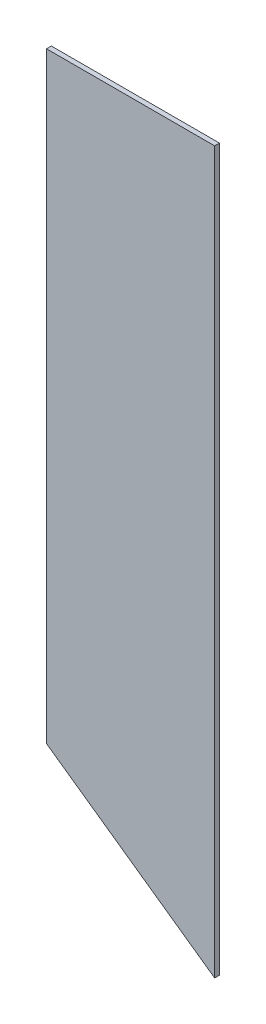
ISO-10303-21;
HEADER;
FILE_DESCRIPTION(('STEP AP214'),'2;1');
FILE_NAME('part.step','',(''),(''),'','','');
FILE_SCHEMA(('AUTOMOTIVE_DESIGN { 1 0 10303 214 1 1 1 1 }'));
ENDSEC;
DATA;
#1=APPLICATION_CONTEXT('core data for automotive mechanical design processes');
#2=APPLICATION_PROTOCOL_DEFINITION('international standard','automotive_design',2000,#1);
#3=PRODUCT_CONTEXT('',#1,'mechanical');
#4=PRODUCT('Part','Part','',(#3));
#5=PRODUCT_RELATED_PRODUCT_CATEGORY('part','',(#4));
#6=PRODUCT_DEFINITION_FORMATION('','',#4);
#7=PRODUCT_DEFINITION_CONTEXT('part definition',#1,'design');
#8=PRODUCT_DEFINITION('design','',#6,#7);
#9=PRODUCT_DEFINITION_SHAPE('','',#8);
#10=(LENGTH_UNIT() NAMED_UNIT(*) SI_UNIT(.MILLI.,.METRE.));
#11=(NAMED_UNIT(*) PLANE_ANGLE_UNIT() SI_UNIT($,.RADIAN.));
#12=(NAMED_UNIT(*) SI_UNIT($,.STERADIAN.) SOLID_ANGLE_UNIT());
#13=UNCERTAINTY_MEASURE_WITH_UNIT(LENGTH_MEASURE(1.E-05),#10,'distance_accuracy_value','');
#14=(GEOMETRIC_REPRESENTATION_CONTEXT(3) GLOBAL_UNCERTAINTY_ASSIGNED_CONTEXT((#13)) GLOBAL_UNIT_ASSIGNED_CONTEXT((#10,
#11,#12)) REPRESENTATION_CONTEXT('',''));
#15=CARTESIAN_POINT('',(0.,0.,0.));
#16=DIRECTION('',(0.,0.,1.));
#17=DIRECTION('',(1.,0.,0.));
#18=AXIS2_PLACEMENT_3D('',#15,#16,#17);
#19=CARTESIAN_POINT('',(70.,600.,-73.4));
#20=DIRECTION('',(-1.,0.,0.));
#21=DIRECTION('',(0.,-1.,0.));
#22=AXIS2_PLACEMENT_3D('',#19,#20,#21);
#23=PLANE('',#22);
#24=DIRECTION('',(0.,-1.,0.));
#25=VECTOR('',#24,1.);
#26=CARTESIAN_POINT('',(70.,600.,-69.4));
#27=LINE('',#26,#25);
#28=CARTESIAN_POINT('',(70.,600.,-69.4));
#29=VERTEX_POINT('',#28);
#30=CARTESIAN_POINT('',(69.9999999999999,-0.0627416997970439,-69.4));
#31=VERTEX_POINT('',#30);
#32=EDGE_CURVE('E109',#29,#31,#27,.T.);
#33=ORIENTED_EDGE('',*,*,#32,.T.);
#34=DIRECTION('',(0.,0.,1.));
#35=VECTOR('',#34,1.);
#36=CARTESIAN_POINT('',(69.9999999999999,-0.0627416997970439,-73.4));
#37=LINE('',#36,#35);
#38=CARTESIAN_POINT('',(69.9999999999999,-0.0627416997970439,-73.4));
#39=VERTEX_POINT('',#38);
#40=EDGE_CURVE('E11',#39,#31,#37,.T.);
#41=ORIENTED_EDGE('',*,*,#40,.F.);
#42=DIRECTION('',(0.,-1.,0.));
#43=VECTOR('',#42,1.);
#44=CARTESIAN_POINT('',(70.,600.,-73.4));
#45=LINE('',#44,#43);
#46=CARTESIAN_POINT('',(70.,600.,-73.4));
#47=VERTEX_POINT('',#46);
#48=EDGE_CURVE('E92',#47,#39,#45,.T.);
#49=ORIENTED_EDGE('',*,*,#48,.F.);
#50=DIRECTION('',(0.,0.,1.));
#51=VECTOR('',#50,1.);
#52=CARTESIAN_POINT('',(70.,600.,-73.4));
#53=LINE('',#52,#51);
#54=EDGE_CURVE('E105',#47,#29,#53,.T.);
#55=ORIENTED_EDGE('',*,*,#54,.T.);
#56=EDGE_LOOP('',(#33,#41,#49,#55));
#57=FACE_BOUND('',#56,.T.);
#58=ADVANCED_FACE('F40',(#57),#23,.F.);
#59=CARTESIAN_POINT('',(69.9999999999999,-0.0627416997970439,-73.4));
#60=DIRECTION('',(0.577350269189624,0.816496580927727,0.));
#61=DIRECTION('',(-0.816496580927727,0.577350269189624,0.));
#62=AXIS2_PLACEMENT_3D('',#59,#60,#61);
#63=PLANE('',#62);
#64=DIRECTION('',(-0.816496580927727,0.577350269189624,0.));
#65=VECTOR('',#64,1.);
#66=CARTESIAN_POINT('',(69.9999999999999,-0.0627416997970439,-69.4));
#67=LINE('',#66,#65);
#68=CARTESIAN_POINT('',(-70.,98.9322076663191,-69.4));
#69=VERTEX_POINT('',#68);
#70=EDGE_CURVE('E97',#31,#69,#67,.T.);
#71=ORIENTED_EDGE('',*,*,#70,.T.);
#72=DIRECTION('',(0.,0.,1.));
#73=VECTOR('',#72,1.);
#74=CARTESIAN_POINT('',(-70.,98.9322076663191,-73.4));
#75=LINE('',#74,#73);
#76=CARTESIAN_POINT('',(-70.,98.9322076663191,-73.4));
#77=VERTEX_POINT('',#76);
#78=EDGE_CURVE('E49',#77,#69,#75,.T.);
#79=ORIENTED_EDGE('',*,*,#78,.F.);
#80=DIRECTION('',(-0.816496580927727,0.577350269189624,0.));
#81=VECTOR('',#80,1.);
#82=CARTESIAN_POINT('',(69.9999999999999,-0.0627416997970439,-73.4));
#83=LINE('',#82,#81);
#84=EDGE_CURVE('E87',#39,#77,#83,.T.);
#85=ORIENTED_EDGE('',*,*,#84,.F.);
#86=ORIENTED_EDGE('',*,*,#40,.T.);
#87=EDGE_LOOP('',(#71,#79,#85,#86));
#88=FACE_BOUND('',#87,.T.);
#89=ADVANCED_FACE('F96',(#88),#63,.F.);
#90=CARTESIAN_POINT('',(-70.,600.,-73.4));
#91=DIRECTION('',(1.,0.,0.));
#92=DIRECTION('',(0.,1.,0.));
#93=AXIS2_PLACEMENT_3D('',#90,#91,#92);
#94=PLANE('',#93);
#95=DIRECTION('',(0.,1.,0.));
#96=VECTOR('',#95,1.);
#97=CARTESIAN_POINT('',(-70.,600.,-69.4));
#98=LINE('',#97,#96);
#99=CARTESIAN_POINT('',(-70.,600.,-69.4));
#100=VERTEX_POINT('',#99);
#101=EDGE_CURVE('E74',#69,#100,#98,.T.);
#102=ORIENTED_EDGE('',*,*,#101,.T.);
#103=DIRECTION('',(0.,0.,1.));
#104=VECTOR('',#103,1.);
#105=CARTESIAN_POINT('',(-70.,600.,-73.4));
#106=LINE('',#105,#104);
#107=CARTESIAN_POINT('',(-70.,600.,-73.4));
#108=VERTEX_POINT('',#107);
#109=EDGE_CURVE('E99',#108,#100,#106,.T.);
#110=ORIENTED_EDGE('',*,*,#109,.F.);
#111=DIRECTION('',(0.,1.,0.));
#112=VECTOR('',#111,1.);
#113=CARTESIAN_POINT('',(-70.,600.,-73.4));
#114=LINE('',#113,#112);
#115=EDGE_CURVE('E90',#77,#108,#114,.T.);
#116=ORIENTED_EDGE('',*,*,#115,.F.);
#117=ORIENTED_EDGE('',*,*,#78,.T.);
#118=EDGE_LOOP('',(#102,#110,#116,#117));
#119=FACE_BOUND('',#118,.T.);
#120=ADVANCED_FACE('F100',(#119),#94,.F.);
#121=CARTESIAN_POINT('',(70.,600.,-73.4));
#122=DIRECTION('',(0.,-1.,0.));
#123=DIRECTION('',(0.,0.,-1.));
#124=AXIS2_PLACEMENT_3D('',#121,#122,#123);
#125=PLANE('',#124);
#126=DIRECTION('',(1.,0.,0.));
#127=VECTOR('',#126,1.);
#128=CARTESIAN_POINT('',(70.,600.,-69.4));
#129=LINE('',#128,#127);
#130=EDGE_CURVE('E80',#100,#29,#129,.T.);
#131=ORIENTED_EDGE('',*,*,#130,.T.);
#132=ORIENTED_EDGE('',*,*,#54,.F.);
#133=DIRECTION('',(1.,0.,0.));
#134=VECTOR('',#133,1.);
#135=CARTESIAN_POINT('',(70.,600.,-73.4));
#136=LINE('',#135,#134);
#137=EDGE_CURVE('E57',#108,#47,#136,.T.);
#138=ORIENTED_EDGE('',*,*,#137,.F.);
#139=ORIENTED_EDGE('',*,*,#109,.T.);
#140=EDGE_LOOP('',(#131,#132,#138,#139));
#141=FACE_BOUND('',#140,.T.);
#142=ADVANCED_FACE('F124',(#141),#125,.F.);
#143=CARTESIAN_POINT('',(0.,0.,-73.4));
#144=DIRECTION('',(0.,0.,-1.));
#145=DIRECTION('',(-1.,0.,0.));
#146=AXIS2_PLACEMENT_3D('',#143,#144,#145);
#147=PLANE('',#146);
#148=ORIENTED_EDGE('',*,*,#48,.T.);
#149=ORIENTED_EDGE('',*,*,#84,.T.);
#150=ORIENTED_EDGE('',*,*,#115,.T.);
#151=ORIENTED_EDGE('',*,*,#137,.T.);
#152=EDGE_LOOP('',(#148,#149,#150,#151));
#153=FACE_BOUND('',#152,.T.);
#154=ADVANCED_FACE('F88',(#153),#147,.T.);
#155=CARTESIAN_POINT('',(0.,0.,-69.4));
#156=DIRECTION('',(0.,0.,-1.));
#157=DIRECTION('',(-1.,0.,0.));
#158=AXIS2_PLACEMENT_3D('',#155,#156,#157);
#159=PLANE('',#158);
#160=ORIENTED_EDGE('',*,*,#32,.F.);
#161=ORIENTED_EDGE('',*,*,#130,.F.);
#162=ORIENTED_EDGE('',*,*,#101,.F.);
#163=ORIENTED_EDGE('',*,*,#70,.F.);
#164=EDGE_LOOP('',(#160,#161,#162,#163));
#165=FACE_BOUND('',#164,.T.);
#166=ADVANCED_FACE('F127',(#165),#159,.F.);
#167=CLOSED_SHELL('',(#58,#89,#120,#142,#154,#166));
#168=MANIFOLD_SOLID_BREP('B2',#167);
#169=ADVANCED_BREP_SHAPE_REPRESENTATION('',(#18,#168),#14);
#170=SHAPE_DEFINITION_REPRESENTATION(#9,#169);
ENDSEC;
END-ISO-10303-21;
